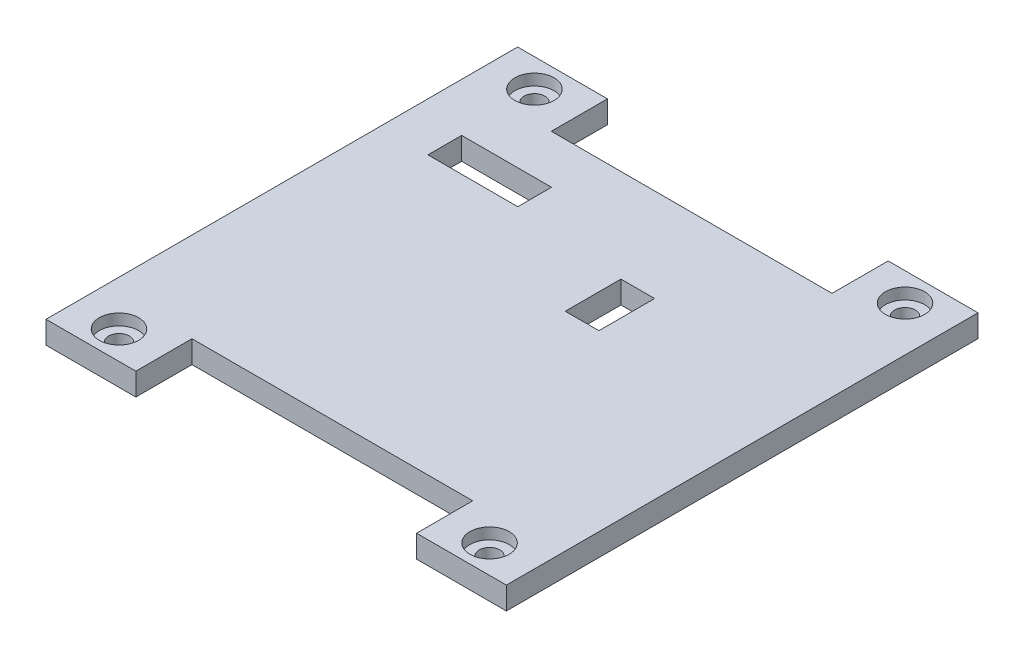
ISO-10303-21;
HEADER;
FILE_DESCRIPTION(('STEP AP214'),'2;1');
FILE_NAME('part.step','',(''),(''),'','','');
FILE_SCHEMA(('AUTOMOTIVE_DESIGN { 1 0 10303 214 1 1 1 1 }'));
ENDSEC;
DATA;
#1=APPLICATION_CONTEXT('core data for automotive mechanical design processes');
#2=APPLICATION_PROTOCOL_DEFINITION('international standard','automotive_design',2000,#1);
#3=PRODUCT_CONTEXT('',#1,'mechanical');
#4=PRODUCT('Part','Part','',(#3));
#5=PRODUCT_RELATED_PRODUCT_CATEGORY('part','',(#4));
#6=PRODUCT_DEFINITION_FORMATION('','',#4);
#7=PRODUCT_DEFINITION_CONTEXT('part definition',#1,'design');
#8=PRODUCT_DEFINITION('design','',#6,#7);
#9=PRODUCT_DEFINITION_SHAPE('','',#8);
#10=(LENGTH_UNIT() NAMED_UNIT(*) SI_UNIT(.MILLI.,.METRE.));
#11=(NAMED_UNIT(*) PLANE_ANGLE_UNIT() SI_UNIT($,.RADIAN.));
#12=(NAMED_UNIT(*) SI_UNIT($,.STERADIAN.) SOLID_ANGLE_UNIT());
#13=UNCERTAINTY_MEASURE_WITH_UNIT(LENGTH_MEASURE(1.E-05),#10,'distance_accuracy_value','');
#14=(GEOMETRIC_REPRESENTATION_CONTEXT(3) GLOBAL_UNCERTAINTY_ASSIGNED_CONTEXT((#13)) GLOBAL_UNIT_ASSIGNED_CONTEXT((#10,
#11,#12)) REPRESENTATION_CONTEXT('',''));
#15=CARTESIAN_POINT('',(0.,0.,0.));
#16=DIRECTION('',(0.,0.,1.));
#17=DIRECTION('',(1.,0.,0.));
#18=AXIS2_PLACEMENT_3D('',#15,#16,#17);
#19=CARTESIAN_POINT('',(0.,0.,0.));
#20=DIRECTION('',(0.,1.,0.));
#21=DIRECTION('',(0.,0.,1.));
#22=AXIS2_PLACEMENT_3D('',#19,#20,#21);
#23=PLANE('',#22);
#24=DIRECTION('',(1.,0.,0.));
#25=VECTOR('',#24,1.);
#26=CARTESIAN_POINT('',(-11.857851807008,0.,-11.019264119323));
#27=LINE('',#26,#25);
#28=CARTESIAN_POINT('',(-11.857851807008,0.,-11.019264119323));
#29=VERTEX_POINT('',#28);
#30=CARTESIAN_POINT('',(-3.85785180700805,0.,-11.019264119323));
#31=VERTEX_POINT('',#30);
#32=EDGE_CURVE('E248',#29,#31,#27,.T.);
#33=ORIENTED_EDGE('',*,*,#32,.F.);
#34=DIRECTION('',(0.,0.,-1.));
#35=VECTOR('',#34,1.);
#36=CARTESIAN_POINT('',(-11.857851807008,0.,-11.019264119323));
#37=LINE('',#36,#35);
#38=CARTESIAN_POINT('',(-11.857851807008,0.,-8.01926411932297));
#39=VERTEX_POINT('',#38);
#40=EDGE_CURVE('E51',#39,#29,#37,.T.);
#41=ORIENTED_EDGE('',*,*,#40,.F.);
#42=DIRECTION('',(-1.,0.,0.));
#43=VECTOR('',#42,1.);
#44=CARTESIAN_POINT('',(-11.857851807008,0.,-8.01926411932297));
#45=LINE('',#44,#43);
#46=CARTESIAN_POINT('',(-3.85785180700805,0.,-8.01926411932297));
#47=VERTEX_POINT('',#46);
#48=EDGE_CURVE('E237',#47,#39,#45,.T.);
#49=ORIENTED_EDGE('',*,*,#48,.F.);
#50=DIRECTION('',(0.,0.,1.));
#51=VECTOR('',#50,1.);
#52=CARTESIAN_POINT('',(-3.85785180700805,0.,-11.019264119323));
#53=LINE('',#52,#51);
#54=EDGE_CURVE('E251',#31,#47,#53,.T.);
#55=ORIENTED_EDGE('',*,*,#54,.F.);
#56=EDGE_LOOP('',(#33,#41,#49,#55));
#57=FACE_BOUND('',#56,.T.);
#58=DIRECTION('',(0.,0.,1.));
#59=VECTOR('',#58,1.);
#60=CARTESIAN_POINT('',(-16.1830985915493,0.,-15.3286384976526));
#61=LINE('',#60,#59);
#62=CARTESIAN_POINT('',(-16.1830985915493,0.,-20.3286384976526));
#63=VERTEX_POINT('',#62);
#64=CARTESIAN_POINT('',(-16.1830985915493,0.,21.6713615023474));
#65=VERTEX_POINT('',#64);
#66=EDGE_CURVE('E395',#63,#65,#61,.T.);
#67=ORIENTED_EDGE('',*,*,#66,.F.);
#68=DIRECTION('',(-1.,0.,0.));
#69=VECTOR('',#68,1.);
#70=CARTESIAN_POINT('',(-16.1830985915493,0.,-20.3286384976526));
#71=LINE('',#70,#69);
#72=CARTESIAN_POINT('',(-8.18309859154927,0.,-20.3286384976526));
#73=VERTEX_POINT('',#72);
#74=EDGE_CURVE('E383',#73,#63,#71,.T.);
#75=ORIENTED_EDGE('',*,*,#74,.F.);
#76=DIRECTION('',(0.,0.,1.));
#77=VECTOR('',#76,1.);
#78=CARTESIAN_POINT('',(-8.18309859154927,0.,-20.3286384976526));
#79=LINE('',#78,#77);
#80=CARTESIAN_POINT('',(-8.18309859154927,0.,-15.3286384976526));
#81=VERTEX_POINT('',#80);
#82=EDGE_CURVE('E386',#73,#81,#79,.T.);
#83=ORIENTED_EDGE('',*,*,#82,.T.);
#84=DIRECTION('',(-1.,0.,0.));
#85=VECTOR('',#84,1.);
#86=CARTESIAN_POINT('',(-16.1830985915493,0.,-15.3286384976526));
#87=LINE('',#86,#85);
#88=CARTESIAN_POINT('',(16.8169014084507,0.,-15.3286384976526));
#89=VERTEX_POINT('',#88);
#90=EDGE_CURVE('E11',#89,#81,#87,.T.);
#91=ORIENTED_EDGE('',*,*,#90,.F.);
#92=DIRECTION('',(0.,0.,1.));
#93=VECTOR('',#92,1.);
#94=CARTESIAN_POINT('',(16.8169014084507,0.,-20.3286384976526));
#95=LINE('',#94,#93);
#96=CARTESIAN_POINT('',(16.8169014084507,0.,-20.3286384976526));
#97=VERTEX_POINT('',#96);
#98=EDGE_CURVE('E372',#97,#89,#95,.T.);
#99=ORIENTED_EDGE('',*,*,#98,.F.);
#100=DIRECTION('',(-1.,0.,0.));
#101=VECTOR('',#100,1.);
#102=CARTESIAN_POINT('',(24.8169014084507,0.,-20.3286384976526));
#103=LINE('',#102,#101);
#104=CARTESIAN_POINT('',(24.8169014084507,0.,-20.3286384976526));
#105=VERTEX_POINT('',#104);
#106=EDGE_CURVE('E360',#105,#97,#103,.T.);
#107=ORIENTED_EDGE('',*,*,#106,.F.);
#108=DIRECTION('',(0.,0.,-1.));
#109=VECTOR('',#108,1.);
#110=CARTESIAN_POINT('',(24.8169014084507,0.,-15.3286384976526));
#111=LINE('',#110,#109);
#112=CARTESIAN_POINT('',(24.8169014084507,0.,21.6713615023474));
#113=VERTEX_POINT('',#112);
#114=EDGE_CURVE('E43',#113,#105,#111,.T.);
#115=ORIENTED_EDGE('',*,*,#114,.F.);
#116=DIRECTION('',(1.,0.,0.));
#117=VECTOR('',#116,1.);
#118=CARTESIAN_POINT('',(24.8169014084507,0.,21.6713615023474));
#119=LINE('',#118,#117);
#120=CARTESIAN_POINT('',(16.8169014084507,0.,21.6713615023474));
#121=VERTEX_POINT('',#120);
#122=EDGE_CURVE('E345',#121,#113,#119,.T.);
#123=ORIENTED_EDGE('',*,*,#122,.F.);
#124=DIRECTION('',(0.,0.,-1.));
#125=VECTOR('',#124,1.);
#126=CARTESIAN_POINT('',(16.8169014084507,0.,21.6713615023474));
#127=LINE('',#126,#125);
#128=CARTESIAN_POINT('',(16.8169014084507,0.,16.6713615023474));
#129=VERTEX_POINT('',#128);
#130=EDGE_CURVE('E348',#121,#129,#127,.T.);
#131=ORIENTED_EDGE('',*,*,#130,.T.);
#132=DIRECTION('',(1.,0.,0.));
#133=VECTOR('',#132,1.);
#134=CARTESIAN_POINT('',(-16.1830985915493,0.,16.6713615023474));
#135=LINE('',#134,#133);
#136=CARTESIAN_POINT('',(-8.18309859154927,0.,16.6713615023474));
#137=VERTEX_POINT('',#136);
#138=EDGE_CURVE('E397',#137,#129,#135,.T.);
#139=ORIENTED_EDGE('',*,*,#138,.F.);
#140=DIRECTION('',(0.,0.,-1.));
#141=VECTOR('',#140,1.);
#142=CARTESIAN_POINT('',(-8.18309859154927,0.,21.6713615023474));
#143=LINE('',#142,#141);
#144=CARTESIAN_POINT('',(-8.18309859154927,0.,21.6713615023474));
#145=VERTEX_POINT('',#144);
#146=EDGE_CURVE('E334',#145,#137,#143,.T.);
#147=ORIENTED_EDGE('',*,*,#146,.F.);
#148=DIRECTION('',(1.,0.,0.));
#149=VECTOR('',#148,1.);
#150=CARTESIAN_POINT('',(-16.1830985915493,0.,21.6713615023474));
#151=LINE('',#150,#149);
#152=EDGE_CURVE('E320',#65,#145,#151,.T.);
#153=ORIENTED_EDGE('',*,*,#152,.F.);
#154=EDGE_LOOP('',(#67,#75,#83,#91,#99,#107,#115,#123,#131,#139,#147,#153));
#155=FACE_BOUND('',#154,.T.);
#156=CARTESIAN_POINT('',(-12.1830985915493,0.,-17.8286384976526));
#157=DIRECTION('',(0.,1.,0.));
#158=DIRECTION('',(0.,0.,1.));
#159=AXIS2_PLACEMENT_3D('',#156,#157,#158);
#160=CIRCLE('',#159,0.925);
#161=CARTESIAN_POINT('',(-12.1830985915493,0.,-16.9036384976526));
#162=VERTEX_POINT('',#161);
#163=EDGE_CURVE('E407',#162,#162,#160,.T.);
#164=ORIENTED_EDGE('',*,*,#163,.T.);
#165=EDGE_LOOP('',(#164));
#166=FACE_BOUND('',#165,.T.);
#167=CARTESIAN_POINT('',(20.8169014084507,0.,-17.8286384976526));
#168=DIRECTION('',(0.,1.,0.));
#169=DIRECTION('',(0.,0.,1.));
#170=AXIS2_PLACEMENT_3D('',#167,#168,#169);
#171=CIRCLE('',#170,0.924999999999998);
#172=CARTESIAN_POINT('',(20.8169014084507,0.,-16.9036384976526));
#173=VERTEX_POINT('',#172);
#174=EDGE_CURVE('E410',#173,#173,#171,.T.);
#175=ORIENTED_EDGE('',*,*,#174,.T.);
#176=EDGE_LOOP('',(#175));
#177=FACE_BOUND('',#176,.T.);
#178=CARTESIAN_POINT('',(20.8169014084507,0.,19.1713615023474));
#179=DIRECTION('',(0.,1.,0.));
#180=DIRECTION('',(0.,0.,1.));
#181=AXIS2_PLACEMENT_3D('',#178,#179,#180);
#182=CIRCLE('',#181,0.924999999999998);
#183=CARTESIAN_POINT('',(20.8169014084507,0.,20.0963615023474));
#184=VERTEX_POINT('',#183);
#185=EDGE_CURVE('E413',#184,#184,#182,.T.);
#186=ORIENTED_EDGE('',*,*,#185,.T.);
#187=EDGE_LOOP('',(#186));
#188=FACE_BOUND('',#187,.T.);
#189=CARTESIAN_POINT('',(-12.1830985915493,0.,19.1713615023474));
#190=DIRECTION('',(0.,1.,0.));
#191=DIRECTION('',(0.,0.,1.));
#192=AXIS2_PLACEMENT_3D('',#189,#190,#191);
#193=CIRCLE('',#192,0.925);
#194=CARTESIAN_POINT('',(-12.1830985915493,0.,20.0963615023474));
#195=VERTEX_POINT('',#194);
#196=EDGE_CURVE('E331',#195,#195,#193,.T.);
#197=ORIENTED_EDGE('',*,*,#196,.T.);
#198=EDGE_LOOP('',(#197));
#199=FACE_BOUND('',#198,.T.);
#200=DIRECTION('',(1.,0.,0.));
#201=VECTOR('',#200,1.);
#202=CARTESIAN_POINT('',(9.31690140845073,0.,-7.02838257728644));
#203=LINE('',#202,#201);
#204=CARTESIAN_POINT('',(9.31690140845073,0.,-7.02838257728644));
#205=VERTEX_POINT('',#204);
#206=CARTESIAN_POINT('',(12.3169014084507,0.,-7.02838257728644));
#207=VERTEX_POINT('',#206);
#208=EDGE_CURVE('E274',#205,#207,#203,.T.);
#209=ORIENTED_EDGE('',*,*,#208,.F.);
#210=DIRECTION('',(1.,0.,0.));
#211=VECTOR('',#210,1.);
#212=CARTESIAN_POINT('',(9.31690140845073,0.,-7.02838257728644));
#213=LINE('',#212,#211);
#214=CARTESIAN_POINT('',(6.31690140845073,0.,-7.02838257728644));
#215=VERTEX_POINT('',#214);
#216=EDGE_CURVE('E216',#215,#205,#213,.T.);
#217=ORIENTED_EDGE('',*,*,#216,.F.);
#218=DIRECTION('',(0.,0.,-1.));
#219=VECTOR('',#218,1.);
#220=CARTESIAN_POINT('',(6.31690140845073,0.,-7.02838257728644));
#221=LINE('',#220,#219);
#222=CARTESIAN_POINT('',(6.31690140845073,0.,-2.06889220520878));
#223=VERTEX_POINT('',#222);
#224=EDGE_CURVE('E218',#223,#215,#221,.T.);
#225=ORIENTED_EDGE('',*,*,#224,.F.);
#226=DIRECTION('',(-1.,0.,0.));
#227=VECTOR('',#226,1.);
#228=CARTESIAN_POINT('',(9.31690140845073,0.,-2.06889220520878));
#229=LINE('',#228,#227);
#230=CARTESIAN_POINT('',(9.31690140845073,0.,-2.06889220520878));
#231=VERTEX_POINT('',#230);
#232=EDGE_CURVE('E223',#231,#223,#229,.T.);
#233=ORIENTED_EDGE('',*,*,#232,.F.);
#234=DIRECTION('',(0.,0.,-1.));
#235=VECTOR('',#234,1.);
#236=CARTESIAN_POINT('',(9.31690140845073,0.,-7.02838257728644));
#237=LINE('',#236,#235);
#238=CARTESIAN_POINT('',(9.31690140845073,0.,-2.02838257728644));
#239=VERTEX_POINT('',#238);
#240=EDGE_CURVE('E201',#239,#231,#237,.T.);
#241=ORIENTED_EDGE('',*,*,#240,.F.);
#242=DIRECTION('',(-1.,0.,0.));
#243=VECTOR('',#242,1.);
#244=CARTESIAN_POINT('',(9.31690140845073,0.,-2.02838257728644));
#245=LINE('',#244,#243);
#246=CARTESIAN_POINT('',(12.3169014084507,0.,-2.02838257728644));
#247=VERTEX_POINT('',#246);
#248=EDGE_CURVE('E266',#247,#239,#245,.T.);
#249=ORIENTED_EDGE('',*,*,#248,.F.);
#250=DIRECTION('',(0.,0.,1.));
#251=VECTOR('',#250,1.);
#252=CARTESIAN_POINT('',(12.3169014084507,0.,-7.02838257728644));
#253=LINE('',#252,#251);
#254=EDGE_CURVE('E277',#207,#247,#253,.T.);
#255=ORIENTED_EDGE('',*,*,#254,.F.);
#256=EDGE_LOOP('',(#209,#217,#225,#233,#241,#249,#255));
#257=FACE_BOUND('',#256,.T.);
#258=ADVANCED_FACE('F35',(#57,#155,#166,#177,#188,#199,#257),#23,.F.);
#259=CARTESIAN_POINT('',(-12.1830985915493,-3.,-17.8286384976526));
#260=DIRECTION('',(0.,1.,0.));
#261=DIRECTION('',(0.,0.,1.));
#262=AXIS2_PLACEMENT_3D('',#259,#260,#261);
#263=CYLINDRICAL_SURFACE('',#262,0.925);
#264=ORIENTED_EDGE('',*,*,#163,.F.);
#265=EDGE_LOOP('',(#264));
#266=FACE_BOUND('',#265,.T.);
#267=CARTESIAN_POINT('',(-12.1830985915493,1.,-17.8286384976526));
#268=DIRECTION('',(0.,1.,0.));
#269=DIRECTION('',(0.,0.,1.));
#270=AXIS2_PLACEMENT_3D('',#267,#268,#269);
#271=CIRCLE('',#270,0.925);
#272=CARTESIAN_POINT('',(-12.1830985915493,1.,-16.9036384976526));
#273=VERTEX_POINT('',#272);
#274=EDGE_CURVE('E38',#273,#273,#271,.F.);
#275=ORIENTED_EDGE('',*,*,#274,.F.);
#276=EDGE_LOOP('',(#275));
#277=FACE_BOUND('',#276,.T.);
#278=ADVANCED_FACE('F431',(#266,#277),#263,.F.);
#279=CARTESIAN_POINT('',(20.8169014084507,-3.,-17.8286384976526));
#280=DIRECTION('',(0.,1.,0.));
#281=DIRECTION('',(0.,0.,1.));
#282=AXIS2_PLACEMENT_3D('',#279,#280,#281);
#283=CYLINDRICAL_SURFACE('',#282,0.924999999999998);
#284=ORIENTED_EDGE('',*,*,#174,.F.);
#285=EDGE_LOOP('',(#284));
#286=FACE_BOUND('',#285,.T.);
#287=CARTESIAN_POINT('',(20.8169014084507,1.,-17.8286384976526));
#288=DIRECTION('',(0.,1.,0.));
#289=DIRECTION('',(0.,0.,1.));
#290=AXIS2_PLACEMENT_3D('',#287,#288,#289);
#291=CIRCLE('',#290,0.924999999999998);
#292=CARTESIAN_POINT('',(20.8169014084507,1.,-16.9036384976526));
#293=VERTEX_POINT('',#292);
#294=EDGE_CURVE('E422',#293,#293,#291,.F.);
#295=ORIENTED_EDGE('',*,*,#294,.F.);
#296=EDGE_LOOP('',(#295));
#297=FACE_BOUND('',#296,.T.);
#298=ADVANCED_FACE('F433',(#286,#297),#283,.F.);
#299=CARTESIAN_POINT('',(20.8169014084507,-3.,19.1713615023474));
#300=DIRECTION('',(0.,1.,0.));
#301=DIRECTION('',(0.,0.,1.));
#302=AXIS2_PLACEMENT_3D('',#299,#300,#301);
#303=CYLINDRICAL_SURFACE('',#302,0.924999999999998);
#304=ORIENTED_EDGE('',*,*,#185,.F.);
#305=EDGE_LOOP('',(#304));
#306=FACE_BOUND('',#305,.T.);
#307=CARTESIAN_POINT('',(20.8169014084507,1.,19.1713615023474));
#308=DIRECTION('',(0.,1.,0.));
#309=DIRECTION('',(0.,0.,1.));
#310=AXIS2_PLACEMENT_3D('',#307,#308,#309);
#311=CIRCLE('',#310,0.924999999999998);
#312=CARTESIAN_POINT('',(20.8169014084507,1.,20.0963615023474));
#313=VERTEX_POINT('',#312);
#314=EDGE_CURVE('E420',#313,#313,#311,.F.);
#315=ORIENTED_EDGE('',*,*,#314,.F.);
#316=EDGE_LOOP('',(#315));
#317=FACE_BOUND('',#316,.T.);
#318=ADVANCED_FACE('F440',(#306,#317),#303,.F.);
#319=CARTESIAN_POINT('',(-12.1830985915493,-3.,19.1713615023474));
#320=DIRECTION('',(0.,1.,0.));
#321=DIRECTION('',(0.,0.,1.));
#322=AXIS2_PLACEMENT_3D('',#319,#320,#321);
#323=CYLINDRICAL_SURFACE('',#322,0.925);
#324=ORIENTED_EDGE('',*,*,#196,.F.);
#325=EDGE_LOOP('',(#324));
#326=FACE_BOUND('',#325,.T.);
#327=CARTESIAN_POINT('',(-12.1830985915493,1.,19.1713615023474));
#328=DIRECTION('',(0.,1.,0.));
#329=DIRECTION('',(0.,0.,1.));
#330=AXIS2_PLACEMENT_3D('',#327,#328,#329);
#331=CIRCLE('',#330,0.925);
#332=CARTESIAN_POINT('',(-12.1830985915493,1.,20.0963615023474));
#333=VERTEX_POINT('',#332);
#334=EDGE_CURVE('E314',#333,#333,#331,.F.);
#335=ORIENTED_EDGE('',*,*,#334,.F.);
#336=EDGE_LOOP('',(#335));
#337=FACE_BOUND('',#336,.T.);
#338=ADVANCED_FACE('F447',(#326,#337),#323,.F.);
#339=CARTESIAN_POINT('',(-16.1830985915493,0.,16.6713615023474));
#340=DIRECTION('',(0.,0.,1.));
#341=DIRECTION('',(1.,0.,0.));
#342=AXIS2_PLACEMENT_3D('',#339,#340,#341);
#343=PLANE('',#342);
#344=DIRECTION('',(1.,0.,0.));
#345=VECTOR('',#344,1.);
#346=CARTESIAN_POINT('',(-16.1830985915493,2.,16.6713615023474));
#347=LINE('',#346,#345);
#348=CARTESIAN_POINT('',(-8.18309859154927,2.,16.6713615023474));
#349=VERTEX_POINT('',#348);
#350=CARTESIAN_POINT('',(16.8169014084507,2.,16.6713615023474));
#351=VERTEX_POINT('',#350);
#352=EDGE_CURVE('E402',#349,#351,#347,.T.);
#353=ORIENTED_EDGE('',*,*,#352,.F.);
#354=DIRECTION('',(0.,1.,0.));
#355=VECTOR('',#354,1.);
#356=CARTESIAN_POINT('',(-8.18309859154927,0.,16.6713615023474));
#357=LINE('',#356,#355);
#358=EDGE_CURVE('E321',#137,#349,#357,.T.);
#359=ORIENTED_EDGE('',*,*,#358,.F.);
#360=ORIENTED_EDGE('',*,*,#138,.T.);
#361=DIRECTION('',(0.,-1.,0.));
#362=VECTOR('',#361,1.);
#363=CARTESIAN_POINT('',(16.8169014084507,0.,16.6713615023474));
#364=LINE('',#363,#362);
#365=EDGE_CURVE('E337',#351,#129,#364,.T.);
#366=ORIENTED_EDGE('',*,*,#365,.F.);
#367=EDGE_LOOP('',(#353,#359,#360,#366));
#368=FACE_BOUND('',#367,.T.);
#369=ADVANCED_FACE('F486',(#368),#343,.T.);
#370=CARTESIAN_POINT('',(-16.1830985915493,0.,-15.3286384976526));
#371=DIRECTION('',(0.,0.,-1.));
#372=DIRECTION('',(-1.,0.,0.));
#373=AXIS2_PLACEMENT_3D('',#370,#371,#372);
#374=PLANE('',#373);
#375=DIRECTION('',(-1.,0.,0.));
#376=VECTOR('',#375,1.);
#377=CARTESIAN_POINT('',(-16.1830985915493,2.,-15.3286384976526));
#378=LINE('',#377,#376);
#379=CARTESIAN_POINT('',(16.8169014084507,2.,-15.3286384976526));
#380=VERTEX_POINT('',#379);
#381=CARTESIAN_POINT('',(-8.18309859154927,2.,-15.3286384976526));
#382=VERTEX_POINT('',#381);
#383=EDGE_CURVE('E398',#380,#382,#378,.T.);
#384=ORIENTED_EDGE('',*,*,#383,.F.);
#385=DIRECTION('',(0.,1.,0.));
#386=VECTOR('',#385,1.);
#387=CARTESIAN_POINT('',(16.8169014084507,2.,-15.3286384976526));
#388=LINE('',#387,#386);
#389=EDGE_CURVE('E356',#89,#380,#388,.T.);
#390=ORIENTED_EDGE('',*,*,#389,.F.);
#391=ORIENTED_EDGE('',*,*,#90,.T.);
#392=DIRECTION('',(0.,-1.,0.));
#393=VECTOR('',#392,1.);
#394=CARTESIAN_POINT('',(-8.18309859154927,2.,-15.3286384976526));
#395=LINE('',#394,#393);
#396=EDGE_CURVE('E375',#382,#81,#395,.T.);
#397=ORIENTED_EDGE('',*,*,#396,.F.);
#398=EDGE_LOOP('',(#384,#390,#391,#397));
#399=FACE_BOUND('',#398,.T.);
#400=ADVANCED_FACE('F482',(#399),#374,.T.);
#401=CARTESIAN_POINT('',(-16.1830985915493,0.,-15.3286384976526));
#402=DIRECTION('',(-1.,0.,0.));
#403=DIRECTION('',(0.,0.,1.));
#404=AXIS2_PLACEMENT_3D('',#401,#402,#403);
#405=PLANE('',#404);
#406=DIRECTION('',(0.,0.,1.));
#407=VECTOR('',#406,1.);
#408=CARTESIAN_POINT('',(-16.1830985915493,2.,-15.3286384976526));
#409=LINE('',#408,#407);
#410=CARTESIAN_POINT('',(-16.1830985915493,2.,-20.3286384976526));
#411=VERTEX_POINT('',#410);
#412=CARTESIAN_POINT('',(-16.1830985915493,2.,21.6713615023474));
#413=VERTEX_POINT('',#412);
#414=EDGE_CURVE('E394',#411,#413,#409,.T.);
#415=ORIENTED_EDGE('',*,*,#414,.F.);
#416=DIRECTION('',(0.,1.,0.));
#417=VECTOR('',#416,1.);
#418=CARTESIAN_POINT('',(-16.1830985915493,2.,-20.3286384976526));
#419=LINE('',#418,#417);
#420=EDGE_CURVE('E376',#63,#411,#419,.T.);
#421=ORIENTED_EDGE('',*,*,#420,.F.);
#422=ORIENTED_EDGE('',*,*,#66,.T.);
#423=DIRECTION('',(0.,-1.,0.));
#424=VECTOR('',#423,1.);
#425=CARTESIAN_POINT('',(-16.1830985915493,0.,21.6713615023474));
#426=LINE('',#425,#424);
#427=EDGE_CURVE('E317',#413,#65,#426,.T.);
#428=ORIENTED_EDGE('',*,*,#427,.F.);
#429=EDGE_LOOP('',(#415,#421,#422,#428));
#430=FACE_BOUND('',#429,.T.);
#431=ADVANCED_FACE('F485',(#430),#405,.T.);
#432=CARTESIAN_POINT('',(24.8169014084507,0.,-15.3286384976526));
#433=DIRECTION('',(1.,0.,0.));
#434=DIRECTION('',(0.,0.,-1.));
#435=AXIS2_PLACEMENT_3D('',#432,#433,#434);
#436=PLANE('',#435);
#437=DIRECTION('',(0.,0.,-1.));
#438=VECTOR('',#437,1.);
#439=CARTESIAN_POINT('',(24.8169014084507,2.,-15.3286384976526));
#440=LINE('',#439,#438);
#441=CARTESIAN_POINT('',(24.8169014084507,2.,21.6713615023474));
#442=VERTEX_POINT('',#441);
#443=CARTESIAN_POINT('',(24.8169014084507,2.,-20.3286384976526));
#444=VERTEX_POINT('',#443);
#445=EDGE_CURVE('E404',#442,#444,#440,.T.);
#446=ORIENTED_EDGE('',*,*,#445,.F.);
#447=DIRECTION('',(0.,1.,0.));
#448=VECTOR('',#447,1.);
#449=CARTESIAN_POINT('',(24.8169014084507,0.,21.6713615023474));
#450=LINE('',#449,#448);
#451=EDGE_CURVE('E338',#113,#442,#450,.T.);
#452=ORIENTED_EDGE('',*,*,#451,.F.);
#453=ORIENTED_EDGE('',*,*,#114,.T.);
#454=DIRECTION('',(0.,-1.,0.));
#455=VECTOR('',#454,1.);
#456=CARTESIAN_POINT('',(24.8169014084507,2.,-20.3286384976526));
#457=LINE('',#456,#455);
#458=EDGE_CURVE('E357',#444,#105,#457,.T.);
#459=ORIENTED_EDGE('',*,*,#458,.F.);
#460=EDGE_LOOP('',(#446,#452,#453,#459));
#461=FACE_BOUND('',#460,.T.);
#462=ADVANCED_FACE('F488',(#461),#436,.T.);
#463=CARTESIAN_POINT('',(0.,2.,0.));
#464=DIRECTION('',(0.,1.,0.));
#465=DIRECTION('',(0.,0.,1.));
#466=AXIS2_PLACEMENT_3D('',#463,#464,#465);
#467=PLANE('',#466);
#468=DIRECTION('',(0.,0.,1.));
#469=VECTOR('',#468,1.);
#470=CARTESIAN_POINT('',(9.31690140845073,2.,-7.02838257728644));
#471=LINE('',#470,#469);
#472=CARTESIAN_POINT('',(9.31690140845073,2.,-7.02838257728644));
#473=VERTEX_POINT('',#472);
#474=CARTESIAN_POINT('',(9.31690140845073,2.,-2.06889220520878));
#475=VERTEX_POINT('',#474);
#476=EDGE_CURVE('E198',#473,#475,#471,.T.);
#477=ORIENTED_EDGE('',*,*,#476,.T.);
#478=DIRECTION('',(-1.,0.,0.));
#479=VECTOR('',#478,1.);
#480=CARTESIAN_POINT('',(9.31690140845073,2.,-2.06889220520878));
#481=LINE('',#480,#479);
#482=CARTESIAN_POINT('',(6.31690140845073,2.,-2.06889220520878));
#483=VERTEX_POINT('',#482);
#484=EDGE_CURVE('E209',#475,#483,#481,.T.);
#485=ORIENTED_EDGE('',*,*,#484,.T.);
#486=DIRECTION('',(0.,0.,-1.));
#487=VECTOR('',#486,1.);
#488=CARTESIAN_POINT('',(6.31690140845073,2.,-7.02838257728644));
#489=LINE('',#488,#487);
#490=CARTESIAN_POINT('',(6.31690140845073,2.,-7.02838257728644));
#491=VERTEX_POINT('',#490);
#492=EDGE_CURVE('E59',#483,#491,#489,.T.);
#493=ORIENTED_EDGE('',*,*,#492,.T.);
#494=DIRECTION('',(1.,0.,0.));
#495=VECTOR('',#494,1.);
#496=CARTESIAN_POINT('',(9.31690140845073,2.,-7.02838257728644));
#497=LINE('',#496,#495);
#498=EDGE_CURVE('E206',#491,#473,#497,.T.);
#499=ORIENTED_EDGE('',*,*,#498,.T.);
#500=EDGE_LOOP('',(#477,#485,#493,#499));
#501=FACE_BOUND('',#500,.T.);
#502=DIRECTION('',(0.,0.,-1.));
#503=VECTOR('',#502,1.);
#504=CARTESIAN_POINT('',(-11.857851807008,2.,-11.019264119323));
#505=LINE('',#504,#503);
#506=CARTESIAN_POINT('',(-11.857851807008,2.,-8.01926411932297));
#507=VERTEX_POINT('',#506);
#508=CARTESIAN_POINT('',(-11.857851807008,2.,-11.019264119323));
#509=VERTEX_POINT('',#508);
#510=EDGE_CURVE('E233',#507,#509,#505,.T.);
#511=ORIENTED_EDGE('',*,*,#510,.T.);
#512=DIRECTION('',(1.,0.,0.));
#513=VECTOR('',#512,1.);
#514=CARTESIAN_POINT('',(-11.857851807008,2.,-11.019264119323));
#515=LINE('',#514,#513);
#516=CARTESIAN_POINT('',(-3.85785180700805,2.,-11.019264119323));
#517=VERTEX_POINT('',#516);
#518=EDGE_CURVE('E236',#509,#517,#515,.T.);
#519=ORIENTED_EDGE('',*,*,#518,.T.);
#520=DIRECTION('',(0.,0.,1.));
#521=VECTOR('',#520,1.);
#522=CARTESIAN_POINT('',(-3.85785180700805,2.,-11.019264119323));
#523=LINE('',#522,#521);
#524=CARTESIAN_POINT('',(-3.85785180700805,2.,-8.01926411932297));
#525=VERTEX_POINT('',#524);
#526=EDGE_CURVE('E240',#517,#525,#523,.T.);
#527=ORIENTED_EDGE('',*,*,#526,.T.);
#528=DIRECTION('',(-1.,0.,0.));
#529=VECTOR('',#528,1.);
#530=CARTESIAN_POINT('',(-11.857851807008,2.,-8.01926411932297));
#531=LINE('',#530,#529);
#532=EDGE_CURVE('E243',#525,#507,#531,.T.);
#533=ORIENTED_EDGE('',*,*,#532,.T.);
#534=EDGE_LOOP('',(#511,#519,#527,#533));
#535=FACE_BOUND('',#534,.T.);
#536=CARTESIAN_POINT('',(-12.1830985915493,2.,19.1713615023474));
#537=DIRECTION('',(0.,1.,0.));
#538=DIRECTION('',(0.,0.,1.));
#539=AXIS2_PLACEMENT_3D('',#536,#537,#538);
#540=CIRCLE('',#539,1.75);
#541=CARTESIAN_POINT('',(-12.1830985915493,2.,20.9213615023474));
#542=VERTEX_POINT('',#541);
#543=EDGE_CURVE('E292',#542,#542,#540,.T.);
#544=ORIENTED_EDGE('',*,*,#543,.F.);
#545=EDGE_LOOP('',(#544));
#546=FACE_BOUND('',#545,.T.);
#547=CARTESIAN_POINT('',(20.8169014084507,2.,19.1713615023474));
#548=DIRECTION('',(0.,1.,0.));
#549=DIRECTION('',(0.,0.,1.));
#550=AXIS2_PLACEMENT_3D('',#547,#548,#549);
#551=CIRCLE('',#550,1.75);
#552=CARTESIAN_POINT('',(20.8169014084507,2.,20.9213615023474));
#553=VERTEX_POINT('',#552);
#554=EDGE_CURVE('E303',#553,#553,#551,.T.);
#555=ORIENTED_EDGE('',*,*,#554,.F.);
#556=EDGE_LOOP('',(#555));
#557=FACE_BOUND('',#556,.T.);
#558=CARTESIAN_POINT('',(20.8169014084507,2.,-17.8286384976526));
#559=DIRECTION('',(0.,1.,0.));
#560=DIRECTION('',(0.,0.,1.));
#561=AXIS2_PLACEMENT_3D('',#558,#559,#560);
#562=CIRCLE('',#561,1.75);
#563=CARTESIAN_POINT('',(20.8169014084507,2.,-16.0786384976526));
#564=VERTEX_POINT('',#563);
#565=EDGE_CURVE('E297',#564,#564,#562,.T.);
#566=ORIENTED_EDGE('',*,*,#565,.F.);
#567=EDGE_LOOP('',(#566));
#568=FACE_BOUND('',#567,.T.);
#569=CARTESIAN_POINT('',(-12.1830985915493,2.,-17.8286384976526));
#570=DIRECTION('',(0.,1.,0.));
#571=DIRECTION('',(0.,0.,1.));
#572=AXIS2_PLACEMENT_3D('',#569,#570,#571);
#573=CIRCLE('',#572,1.75);
#574=CARTESIAN_POINT('',(-12.1830985915493,2.,-16.0786384976526));
#575=VERTEX_POINT('',#574);
#576=EDGE_CURVE('E296',#575,#575,#573,.T.);
#577=ORIENTED_EDGE('',*,*,#576,.F.);
#578=EDGE_LOOP('',(#577));
#579=FACE_BOUND('',#578,.T.);
#580=ORIENTED_EDGE('',*,*,#414,.T.);
#581=DIRECTION('',(-1.,0.,0.));
#582=VECTOR('',#581,1.);
#583=CARTESIAN_POINT('',(-16.1830985915493,2.,21.6713615023474));
#584=LINE('',#583,#582);
#585=CARTESIAN_POINT('',(-8.18309859154927,2.,21.6713615023474));
#586=VERTEX_POINT('',#585);
#587=EDGE_CURVE('E325',#586,#413,#584,.T.);
#588=ORIENTED_EDGE('',*,*,#587,.F.);
#589=DIRECTION('',(0.,0.,-1.));
#590=VECTOR('',#589,1.);
#591=CARTESIAN_POINT('',(-8.18309859154927,2.,21.6713615023474));
#592=LINE('',#591,#590);
#593=EDGE_CURVE('E328',#586,#349,#592,.T.);
#594=ORIENTED_EDGE('',*,*,#593,.T.);
#595=ORIENTED_EDGE('',*,*,#352,.T.);
#596=DIRECTION('',(0.,0.,-1.));
#597=VECTOR('',#596,1.);
#598=CARTESIAN_POINT('',(16.8169014084507,2.,21.6713615023474));
#599=LINE('',#598,#597);
#600=CARTESIAN_POINT('',(16.8169014084507,2.,21.6713615023474));
#601=VERTEX_POINT('',#600);
#602=EDGE_CURVE('E353',#601,#351,#599,.T.);
#603=ORIENTED_EDGE('',*,*,#602,.F.);
#604=DIRECTION('',(-1.,0.,0.));
#605=VECTOR('',#604,1.);
#606=CARTESIAN_POINT('',(24.8169014084507,2.,21.6713615023474));
#607=LINE('',#606,#605);
#608=EDGE_CURVE('E341',#442,#601,#607,.T.);
#609=ORIENTED_EDGE('',*,*,#608,.F.);
#610=ORIENTED_EDGE('',*,*,#445,.T.);
#611=DIRECTION('',(1.,0.,0.));
#612=VECTOR('',#611,1.);
#613=CARTESIAN_POINT('',(24.8169014084507,2.,-20.3286384976526));
#614=LINE('',#613,#612);
#615=CARTESIAN_POINT('',(16.8169014084507,2.,-20.3286384976526));
#616=VERTEX_POINT('',#615);
#617=EDGE_CURVE('E364',#616,#444,#614,.T.);
#618=ORIENTED_EDGE('',*,*,#617,.F.);
#619=DIRECTION('',(0.,0.,1.));
#620=VECTOR('',#619,1.);
#621=CARTESIAN_POINT('',(16.8169014084507,2.,-20.3286384976526));
#622=LINE('',#621,#620);
#623=EDGE_CURVE('E367',#616,#380,#622,.T.);
#624=ORIENTED_EDGE('',*,*,#623,.T.);
#625=ORIENTED_EDGE('',*,*,#383,.T.);
#626=DIRECTION('',(0.,0.,1.));
#627=VECTOR('',#626,1.);
#628=CARTESIAN_POINT('',(-8.18309859154927,2.,-20.3286384976526));
#629=LINE('',#628,#627);
#630=CARTESIAN_POINT('',(-8.18309859154927,2.,-20.3286384976526));
#631=VERTEX_POINT('',#630);
#632=EDGE_CURVE('E391',#631,#382,#629,.T.);
#633=ORIENTED_EDGE('',*,*,#632,.F.);
#634=DIRECTION('',(1.,0.,0.));
#635=VECTOR('',#634,1.);
#636=CARTESIAN_POINT('',(-16.1830985915493,2.,-20.3286384976526));
#637=LINE('',#636,#635);
#638=EDGE_CURVE('E379',#411,#631,#637,.T.);
#639=ORIENTED_EDGE('',*,*,#638,.F.);
#640=EDGE_LOOP('',(#580,#588,#594,#595,#603,#609,#610,#618,#624,#625,#633,#639));
#641=FACE_BOUND('',#640,.T.);
#642=ADVANCED_FACE('F213',(#501,#535,#546,#557,#568,#579,#641),#467,.T.);
#643=CARTESIAN_POINT('',(-8.18309859154927,2.,-20.3286384976526));
#644=DIRECTION('',(-1.,0.,0.));
#645=DIRECTION('',(0.,0.,1.));
#646=AXIS2_PLACEMENT_3D('',#643,#644,#645);
#647=PLANE('',#646);
#648=ORIENTED_EDGE('',*,*,#396,.T.);
#649=ORIENTED_EDGE('',*,*,#82,.F.);
#650=DIRECTION('',(0.,-1.,0.));
#651=VECTOR('',#650,1.);
#652=CARTESIAN_POINT('',(-8.18309859154927,2.,-20.3286384976526));
#653=LINE('',#652,#651);
#654=EDGE_CURVE('E381',#631,#73,#653,.T.);
#655=ORIENTED_EDGE('',*,*,#654,.F.);
#656=ORIENTED_EDGE('',*,*,#632,.T.);
#657=EDGE_LOOP('',(#648,#649,#655,#656));
#658=FACE_BOUND('',#657,.T.);
#659=ADVANCED_FACE('F477',(#658),#647,.F.);
#660=CARTESIAN_POINT('',(0.,0.,-20.3286384976526));
#661=DIRECTION('',(0.,0.,1.));
#662=DIRECTION('',(1.,0.,0.));
#663=AXIS2_PLACEMENT_3D('',#660,#661,#662);
#664=PLANE('',#663);
#665=ORIENTED_EDGE('',*,*,#420,.T.);
#666=ORIENTED_EDGE('',*,*,#638,.T.);
#667=ORIENTED_EDGE('',*,*,#654,.T.);
#668=ORIENTED_EDGE('',*,*,#74,.T.);
#669=EDGE_LOOP('',(#665,#666,#667,#668));
#670=FACE_BOUND('',#669,.T.);
#671=ADVANCED_FACE('F473',(#670),#664,.F.);
#672=CARTESIAN_POINT('',(16.8169014084507,2.,-20.3286384976526));
#673=DIRECTION('',(1.,0.,0.));
#674=DIRECTION('',(0.,0.,-1.));
#675=AXIS2_PLACEMENT_3D('',#672,#673,#674);
#676=PLANE('',#675);
#677=ORIENTED_EDGE('',*,*,#389,.T.);
#678=ORIENTED_EDGE('',*,*,#623,.F.);
#679=DIRECTION('',(0.,1.,0.));
#680=VECTOR('',#679,1.);
#681=CARTESIAN_POINT('',(16.8169014084507,2.,-20.3286384976526));
#682=LINE('',#681,#680);
#683=EDGE_CURVE('E362',#97,#616,#682,.T.);
#684=ORIENTED_EDGE('',*,*,#683,.F.);
#685=ORIENTED_EDGE('',*,*,#98,.T.);
#686=EDGE_LOOP('',(#677,#678,#684,#685));
#687=FACE_BOUND('',#686,.T.);
#688=ADVANCED_FACE('F469',(#687),#676,.F.);
#689=CARTESIAN_POINT('',(0.,0.,-20.3286384976526));
#690=DIRECTION('',(0.,0.,-1.));
#691=DIRECTION('',(-1.,0.,0.));
#692=AXIS2_PLACEMENT_3D('',#689,#690,#691);
#693=PLANE('',#692);
#694=ORIENTED_EDGE('',*,*,#458,.T.);
#695=ORIENTED_EDGE('',*,*,#106,.T.);
#696=ORIENTED_EDGE('',*,*,#683,.T.);
#697=ORIENTED_EDGE('',*,*,#617,.T.);
#698=EDGE_LOOP('',(#694,#695,#696,#697));
#699=FACE_BOUND('',#698,.T.);
#700=ADVANCED_FACE('F465',(#699),#693,.T.);
#701=CARTESIAN_POINT('',(16.8169014084507,0.,21.6713615023474));
#702=DIRECTION('',(1.,0.,0.));
#703=DIRECTION('',(0.,0.,-1.));
#704=AXIS2_PLACEMENT_3D('',#701,#702,#703);
#705=PLANE('',#704);
#706=ORIENTED_EDGE('',*,*,#365,.T.);
#707=ORIENTED_EDGE('',*,*,#130,.F.);
#708=DIRECTION('',(0.,-1.,0.));
#709=VECTOR('',#708,1.);
#710=CARTESIAN_POINT('',(16.8169014084507,0.,21.6713615023474));
#711=LINE('',#710,#709);
#712=EDGE_CURVE('E343',#601,#121,#711,.T.);
#713=ORIENTED_EDGE('',*,*,#712,.F.);
#714=ORIENTED_EDGE('',*,*,#602,.T.);
#715=EDGE_LOOP('',(#706,#707,#713,#714));
#716=FACE_BOUND('',#715,.T.);
#717=ADVANCED_FACE('F461',(#716),#705,.F.);
#718=CARTESIAN_POINT('',(0.,0.,21.6713615023474));
#719=DIRECTION('',(0.,0.,1.));
#720=DIRECTION('',(1.,0.,0.));
#721=AXIS2_PLACEMENT_3D('',#718,#719,#720);
#722=PLANE('',#721);
#723=ORIENTED_EDGE('',*,*,#451,.T.);
#724=ORIENTED_EDGE('',*,*,#608,.T.);
#725=ORIENTED_EDGE('',*,*,#712,.T.);
#726=ORIENTED_EDGE('',*,*,#122,.T.);
#727=EDGE_LOOP('',(#723,#724,#725,#726));
#728=FACE_BOUND('',#727,.T.);
#729=ADVANCED_FACE('F457',(#728),#722,.T.);
#730=CARTESIAN_POINT('',(-8.18309859154927,0.,21.6713615023474));
#731=DIRECTION('',(-1.,0.,0.));
#732=DIRECTION('',(0.,0.,1.));
#733=AXIS2_PLACEMENT_3D('',#730,#731,#732);
#734=PLANE('',#733);
#735=ORIENTED_EDGE('',*,*,#358,.T.);
#736=ORIENTED_EDGE('',*,*,#593,.F.);
#737=DIRECTION('',(0.,1.,0.));
#738=VECTOR('',#737,1.);
#739=CARTESIAN_POINT('',(-8.18309859154927,0.,21.6713615023474));
#740=LINE('',#739,#738);
#741=EDGE_CURVE('E323',#145,#586,#740,.T.);
#742=ORIENTED_EDGE('',*,*,#741,.F.);
#743=ORIENTED_EDGE('',*,*,#146,.T.);
#744=EDGE_LOOP('',(#735,#736,#742,#743));
#745=FACE_BOUND('',#744,.T.);
#746=ADVANCED_FACE('F453',(#745),#734,.F.);
#747=CARTESIAN_POINT('',(0.,0.,21.6713615023474));
#748=DIRECTION('',(0.,0.,-1.));
#749=DIRECTION('',(-1.,0.,0.));
#750=AXIS2_PLACEMENT_3D('',#747,#748,#749);
#751=PLANE('',#750);
#752=ORIENTED_EDGE('',*,*,#427,.T.);
#753=ORIENTED_EDGE('',*,*,#152,.T.);
#754=ORIENTED_EDGE('',*,*,#741,.T.);
#755=ORIENTED_EDGE('',*,*,#587,.T.);
#756=EDGE_LOOP('',(#752,#753,#754,#755));
#757=FACE_BOUND('',#756,.T.);
#758=ADVANCED_FACE('F449',(#757),#751,.F.);
#759=CARTESIAN_POINT('',(-12.1830985915493,1.,19.1713615023474));
#760=DIRECTION('',(0.,1.,0.));
#761=DIRECTION('',(0.,0.,1.));
#762=AXIS2_PLACEMENT_3D('',#759,#760,#761);
#763=PLANE('',#762);
#764=CARTESIAN_POINT('',(-12.1830985915493,1.,19.1713615023474));
#765=DIRECTION('',(0.,1.,0.));
#766=DIRECTION('',(0.,0.,1.));
#767=AXIS2_PLACEMENT_3D('',#764,#765,#766);
#768=CIRCLE('',#767,1.75);
#769=CARTESIAN_POINT('',(-12.1830985915493,1.,20.9213615023474));
#770=VERTEX_POINT('',#769);
#771=EDGE_CURVE('E306',#770,#770,#768,.T.);
#772=ORIENTED_EDGE('',*,*,#771,.T.);
#773=EDGE_LOOP('',(#772));
#774=FACE_BOUND('',#773,.T.);
#775=ORIENTED_EDGE('',*,*,#334,.T.);
#776=EDGE_LOOP('',(#775));
#777=FACE_BOUND('',#776,.T.);
#778=ADVANCED_FACE('F452',(#774,#777),#763,.T.);
#779=CARTESIAN_POINT('',(-12.1830985915493,1.,19.1713615023474));
#780=DIRECTION('',(0.,1.,0.));
#781=DIRECTION('',(0.,0.,1.));
#782=AXIS2_PLACEMENT_3D('',#779,#780,#781);
#783=CYLINDRICAL_SURFACE('',#782,1.75);
#784=ORIENTED_EDGE('',*,*,#771,.F.);
#785=EDGE_LOOP('',(#784));
#786=FACE_BOUND('',#785,.T.);
#787=ORIENTED_EDGE('',*,*,#543,.T.);
#788=EDGE_LOOP('',(#787));
#789=FACE_BOUND('',#788,.T.);
#790=ADVANCED_FACE('F544',(#786,#789),#783,.F.);
#791=CARTESIAN_POINT('',(20.8169014084507,1.,19.1713615023474));
#792=DIRECTION('',(0.,1.,0.));
#793=DIRECTION('',(0.,0.,1.));
#794=AXIS2_PLACEMENT_3D('',#791,#792,#793);
#795=PLANE('',#794);
#796=CARTESIAN_POINT('',(20.8169014084507,1.,19.1713615023474));
#797=DIRECTION('',(0.,1.,0.));
#798=DIRECTION('',(0.,0.,1.));
#799=AXIS2_PLACEMENT_3D('',#796,#797,#798);
#800=CIRCLE('',#799,1.75);
#801=CARTESIAN_POINT('',(20.8169014084507,1.,20.9213615023474));
#802=VERTEX_POINT('',#801);
#803=EDGE_CURVE('E300',#802,#802,#800,.T.);
#804=ORIENTED_EDGE('',*,*,#803,.T.);
#805=EDGE_LOOP('',(#804));
#806=FACE_BOUND('',#805,.T.);
#807=ORIENTED_EDGE('',*,*,#314,.T.);
#808=EDGE_LOOP('',(#807));
#809=FACE_BOUND('',#808,.T.);
#810=ADVANCED_FACE('F553',(#806,#809),#795,.T.);
#811=CARTESIAN_POINT('',(20.8169014084507,1.,19.1713615023474));
#812=DIRECTION('',(0.,1.,0.));
#813=DIRECTION('',(0.,0.,1.));
#814=AXIS2_PLACEMENT_3D('',#811,#812,#813);
#815=CYLINDRICAL_SURFACE('',#814,1.75);
#816=ORIENTED_EDGE('',*,*,#803,.F.);
#817=EDGE_LOOP('',(#816));
#818=FACE_BOUND('',#817,.T.);
#819=ORIENTED_EDGE('',*,*,#554,.T.);
#820=EDGE_LOOP('',(#819));
#821=FACE_BOUND('',#820,.T.);
#822=ADVANCED_FACE('F561',(#818,#821),#815,.F.);
#823=CARTESIAN_POINT('',(20.8169014084507,1.,-17.8286384976526));
#824=DIRECTION('',(0.,1.,0.));
#825=DIRECTION('',(0.,0.,1.));
#826=AXIS2_PLACEMENT_3D('',#823,#824,#825);
#827=PLANE('',#826);
#828=CARTESIAN_POINT('',(20.8169014084507,1.,-17.8286384976526));
#829=DIRECTION('',(0.,1.,0.));
#830=DIRECTION('',(0.,0.,1.));
#831=AXIS2_PLACEMENT_3D('',#828,#829,#830);
#832=CIRCLE('',#831,1.75);
#833=CARTESIAN_POINT('',(20.8169014084507,1.,-16.0786384976526));
#834=VERTEX_POINT('',#833);
#835=EDGE_CURVE('E293',#834,#834,#832,.T.);
#836=ORIENTED_EDGE('',*,*,#835,.T.);
#837=EDGE_LOOP('',(#836));
#838=FACE_BOUND('',#837,.T.);
#839=ORIENTED_EDGE('',*,*,#294,.T.);
#840=EDGE_LOOP('',(#839));
#841=FACE_BOUND('',#840,.T.);
#842=ADVANCED_FACE('F569',(#838,#841),#827,.T.);
#843=CARTESIAN_POINT('',(20.8169014084507,1.,-17.8286384976526));
#844=DIRECTION('',(0.,1.,0.));
#845=DIRECTION('',(0.,0.,1.));
#846=AXIS2_PLACEMENT_3D('',#843,#844,#845);
#847=CYLINDRICAL_SURFACE('',#846,1.75);
#848=ORIENTED_EDGE('',*,*,#835,.F.);
#849=EDGE_LOOP('',(#848));
#850=FACE_BOUND('',#849,.T.);
#851=ORIENTED_EDGE('',*,*,#565,.T.);
#852=EDGE_LOOP('',(#851));
#853=FACE_BOUND('',#852,.T.);
#854=ADVANCED_FACE('F577',(#850,#853),#847,.F.);
#855=CARTESIAN_POINT('',(-12.1830985915493,1.,-17.8286384976526));
#856=DIRECTION('',(0.,1.,0.));
#857=DIRECTION('',(0.,0.,1.));
#858=AXIS2_PLACEMENT_3D('',#855,#856,#857);
#859=PLANE('',#858);
#860=CARTESIAN_POINT('',(-12.1830985915493,1.,-17.8286384976526));
#861=DIRECTION('',(0.,1.,0.));
#862=DIRECTION('',(0.,0.,1.));
#863=AXIS2_PLACEMENT_3D('',#860,#861,#862);
#864=CIRCLE('',#863,1.75);
#865=CARTESIAN_POINT('',(-12.1830985915493,1.,-16.0786384976526));
#866=VERTEX_POINT('',#865);
#867=EDGE_CURVE('E311',#866,#866,#864,.T.);
#868=ORIENTED_EDGE('',*,*,#867,.T.);
#869=EDGE_LOOP('',(#868));
#870=FACE_BOUND('',#869,.T.);
#871=ORIENTED_EDGE('',*,*,#274,.T.);
#872=EDGE_LOOP('',(#871));
#873=FACE_BOUND('',#872,.T.);
#874=ADVANCED_FACE('F429',(#870,#873),#859,.T.);
#875=CARTESIAN_POINT('',(-12.1830985915493,1.,-17.8286384976526));
#876=DIRECTION('',(0.,1.,0.));
#877=DIRECTION('',(0.,0.,1.));
#878=AXIS2_PLACEMENT_3D('',#875,#876,#877);
#879=CYLINDRICAL_SURFACE('',#878,1.75);
#880=ORIENTED_EDGE('',*,*,#867,.F.);
#881=EDGE_LOOP('',(#880));
#882=FACE_BOUND('',#881,.T.);
#883=ORIENTED_EDGE('',*,*,#576,.T.);
#884=EDGE_LOOP('',(#883));
#885=FACE_BOUND('',#884,.T.);
#886=ADVANCED_FACE('F592',(#882,#885),#879,.F.);
#887=CARTESIAN_POINT('',(9.31690140845073,-1.2,-7.02838257728644));
#888=DIRECTION('',(1.,0.,0.));
#889=DIRECTION('',(0.,0.,-1.));
#890=AXIS2_PLACEMENT_3D('',#887,#888,#889);
#891=PLANE('',#890);
#892=ORIENTED_EDGE('',*,*,#240,.T.);
#893=DIRECTION('',(0.,-1.,0.));
#894=VECTOR('',#893,1.);
#895=CARTESIAN_POINT('',(9.31690140845073,2.,-2.06889220520878));
#896=LINE('',#895,#894);
#897=EDGE_CURVE('E193',#475,#231,#896,.T.);
#898=ORIENTED_EDGE('',*,*,#897,.F.);
#899=ORIENTED_EDGE('',*,*,#476,.F.);
#900=DIRECTION('',(0.,-1.,0.));
#901=VECTOR('',#900,1.);
#902=CARTESIAN_POINT('',(9.31690140845073,2.,-7.02838257728644));
#903=LINE('',#902,#901);
#904=EDGE_CURVE('E228',#473,#205,#903,.T.);
#905=ORIENTED_EDGE('',*,*,#904,.T.);
#906=DIRECTION('',(0.,1.,0.));
#907=VECTOR('',#906,1.);
#908=CARTESIAN_POINT('',(9.31690140845073,-1.2,-7.02838257728644));
#909=LINE('',#908,#907);
#910=CARTESIAN_POINT('',(9.31690140845073,-1.2,-7.02838257728644));
#911=VERTEX_POINT('',#910);
#912=EDGE_CURVE('E289',#911,#205,#909,.T.);
#913=ORIENTED_EDGE('',*,*,#912,.F.);
#914=DIRECTION('',(0.,0.,-1.));
#915=VECTOR('',#914,1.);
#916=CARTESIAN_POINT('',(9.31690140845073,-1.2,-7.02838257728644));
#917=LINE('',#916,#915);
#918=CARTESIAN_POINT('',(9.31690140845073,-1.2,-2.02838257728644));
#919=VERTEX_POINT('',#918);
#920=EDGE_CURVE('E262',#919,#911,#917,.T.);
#921=ORIENTED_EDGE('',*,*,#920,.F.);
#922=DIRECTION('',(0.,1.,0.));
#923=VECTOR('',#922,1.);
#924=CARTESIAN_POINT('',(9.31690140845073,-1.2,-2.02838257728644));
#925=LINE('',#924,#923);
#926=EDGE_CURVE('E272',#919,#239,#925,.T.);
#927=ORIENTED_EDGE('',*,*,#926,.T.);
#928=EDGE_LOOP('',(#892,#898,#899,#905,#913,#921,#927));
#929=FACE_BOUND('',#928,.T.);
#930=ADVANCED_FACE('F195',(#929),#891,.F.);
#931=CARTESIAN_POINT('',(9.31690140845073,-1.2,-7.02838257728644));
#932=DIRECTION('',(0.,0.,1.));
#933=DIRECTION('',(1.,0.,0.));
#934=AXIS2_PLACEMENT_3D('',#931,#932,#933);
#935=PLANE('',#934);
#936=ORIENTED_EDGE('',*,*,#208,.T.);
#937=DIRECTION('',(0.,1.,0.));
#938=VECTOR('',#937,1.);
#939=CARTESIAN_POINT('',(12.3169014084507,-1.2,-7.02838257728644));
#940=LINE('',#939,#938);
#941=CARTESIAN_POINT('',(12.3169014084507,-1.2,-7.02838257728644));
#942=VERTEX_POINT('',#941);
#943=EDGE_CURVE('E286',#942,#207,#940,.T.);
#944=ORIENTED_EDGE('',*,*,#943,.F.);
#945=DIRECTION('',(1.,0.,0.));
#946=VECTOR('',#945,1.);
#947=CARTESIAN_POINT('',(9.31690140845073,-1.2,-7.02838257728644));
#948=LINE('',#947,#946);
#949=EDGE_CURVE('E265',#911,#942,#948,.T.);
#950=ORIENTED_EDGE('',*,*,#949,.F.);
#951=ORIENTED_EDGE('',*,*,#912,.T.);
#952=EDGE_LOOP('',(#936,#944,#950,#951));
#953=FACE_BOUND('',#952,.T.);
#954=ADVANCED_FACE('F607',(#953),#935,.F.);
#955=CARTESIAN_POINT('',(12.3169014084507,-1.2,-7.02838257728644));
#956=DIRECTION('',(-1.,0.,0.));
#957=DIRECTION('',(0.,0.,1.));
#958=AXIS2_PLACEMENT_3D('',#955,#956,#957);
#959=PLANE('',#958);
#960=ORIENTED_EDGE('',*,*,#254,.T.);
#961=DIRECTION('',(0.,1.,0.));
#962=VECTOR('',#961,1.);
#963=CARTESIAN_POINT('',(12.3169014084507,-1.2,-2.02838257728644));
#964=LINE('',#963,#962);
#965=CARTESIAN_POINT('',(12.3169014084507,-1.2,-2.02838257728644));
#966=VERTEX_POINT('',#965);
#967=EDGE_CURVE('E283',#966,#247,#964,.T.);
#968=ORIENTED_EDGE('',*,*,#967,.F.);
#969=DIRECTION('',(0.,0.,1.));
#970=VECTOR('',#969,1.);
#971=CARTESIAN_POINT('',(12.3169014084507,-1.2,-7.02838257728644));
#972=LINE('',#971,#970);
#973=EDGE_CURVE('E268',#942,#966,#972,.T.);
#974=ORIENTED_EDGE('',*,*,#973,.F.);
#975=ORIENTED_EDGE('',*,*,#943,.T.);
#976=EDGE_LOOP('',(#960,#968,#974,#975));
#977=FACE_BOUND('',#976,.T.);
#978=ADVANCED_FACE('F614',(#977),#959,.F.);
#979=CARTESIAN_POINT('',(9.31690140845073,-1.2,-2.02838257728644));
#980=DIRECTION('',(0.,0.,-1.));
#981=DIRECTION('',(-1.,0.,0.));
#982=AXIS2_PLACEMENT_3D('',#979,#980,#981);
#983=PLANE('',#982);
#984=ORIENTED_EDGE('',*,*,#248,.T.);
#985=ORIENTED_EDGE('',*,*,#926,.F.);
#986=DIRECTION('',(-1.,0.,0.));
#987=VECTOR('',#986,1.);
#988=CARTESIAN_POINT('',(9.31690140845073,-1.2,-2.02838257728644));
#989=LINE('',#988,#987);
#990=EDGE_CURVE('E270',#966,#919,#989,.T.);
#991=ORIENTED_EDGE('',*,*,#990,.F.);
#992=ORIENTED_EDGE('',*,*,#967,.T.);
#993=EDGE_LOOP('',(#984,#985,#991,#992));
#994=FACE_BOUND('',#993,.T.);
#995=ADVANCED_FACE('F622',(#994),#983,.F.);
#996=CARTESIAN_POINT('',(0.,-1.2,0.));
#997=DIRECTION('',(0.,1.,0.));
#998=DIRECTION('',(0.,0.,1.));
#999=AXIS2_PLACEMENT_3D('',#996,#997,#998);
#1000=PLANE('',#999);
#1001=ORIENTED_EDGE('',*,*,#920,.T.);
#1002=ORIENTED_EDGE('',*,*,#949,.T.);
#1003=ORIENTED_EDGE('',*,*,#973,.T.);
#1004=ORIENTED_EDGE('',*,*,#990,.T.);
#1005=EDGE_LOOP('',(#1001,#1002,#1003,#1004));
#1006=FACE_BOUND('',#1005,.T.);
#1007=ADVANCED_FACE('F630',(#1006),#1000,.F.);
#1008=CARTESIAN_POINT('',(9.31690140845073,2.,-7.02838257728644));
#1009=DIRECTION('',(0.,0.,-1.));
#1010=DIRECTION('',(-1.,0.,0.));
#1011=AXIS2_PLACEMENT_3D('',#1008,#1009,#1010);
#1012=PLANE('',#1011);
#1013=ORIENTED_EDGE('',*,*,#216,.T.);
#1014=ORIENTED_EDGE('',*,*,#904,.F.);
#1015=ORIENTED_EDGE('',*,*,#498,.F.);
#1016=DIRECTION('',(0.,-1.,0.));
#1017=VECTOR('',#1016,1.);
#1018=CARTESIAN_POINT('',(6.31690140845073,2.,-7.02838257728644));
#1019=LINE('',#1018,#1017);
#1020=EDGE_CURVE('E230',#491,#215,#1019,.T.);
#1021=ORIENTED_EDGE('',*,*,#1020,.T.);
#1022=EDGE_LOOP('',(#1013,#1014,#1015,#1021));
#1023=FACE_BOUND('',#1022,.T.);
#1024=ADVANCED_FACE('F638',(#1023),#1012,.F.);
#1025=CARTESIAN_POINT('',(6.31690140845073,2.,-7.02838257728644));
#1026=DIRECTION('',(-1.,0.,0.));
#1027=DIRECTION('',(0.,0.,1.));
#1028=AXIS2_PLACEMENT_3D('',#1025,#1026,#1027);
#1029=PLANE('',#1028);
#1030=ORIENTED_EDGE('',*,*,#224,.T.);
#1031=ORIENTED_EDGE('',*,*,#1020,.F.);
#1032=ORIENTED_EDGE('',*,*,#492,.F.);
#1033=DIRECTION('',(0.,-1.,0.));
#1034=VECTOR('',#1033,1.);
#1035=CARTESIAN_POINT('',(6.31690140845073,2.,-2.06889220520878));
#1036=LINE('',#1035,#1034);
#1037=EDGE_CURVE('E205',#483,#223,#1036,.T.);
#1038=ORIENTED_EDGE('',*,*,#1037,.T.);
#1039=EDGE_LOOP('',(#1030,#1031,#1032,#1038));
#1040=FACE_BOUND('',#1039,.T.);
#1041=ADVANCED_FACE('F645',(#1040),#1029,.F.);
#1042=CARTESIAN_POINT('',(9.31690140845073,2.,-2.06889220520878));
#1043=DIRECTION('',(0.,0.,1.));
#1044=DIRECTION('',(1.,0.,0.));
#1045=AXIS2_PLACEMENT_3D('',#1042,#1043,#1044);
#1046=PLANE('',#1045);
#1047=ORIENTED_EDGE('',*,*,#232,.T.);
#1048=ORIENTED_EDGE('',*,*,#1037,.F.);
#1049=ORIENTED_EDGE('',*,*,#484,.F.);
#1050=ORIENTED_EDGE('',*,*,#897,.T.);
#1051=EDGE_LOOP('',(#1047,#1048,#1049,#1050));
#1052=FACE_BOUND('',#1051,.T.);
#1053=ADVANCED_FACE('F210',(#1052),#1046,.F.);
#1054=CARTESIAN_POINT('',(-11.857851807008,2.,-11.019264119323));
#1055=DIRECTION('',(-1.,0.,0.));
#1056=DIRECTION('',(0.,0.,1.));
#1057=AXIS2_PLACEMENT_3D('',#1054,#1055,#1056);
#1058=PLANE('',#1057);
#1059=ORIENTED_EDGE('',*,*,#40,.T.);
#1060=DIRECTION('',(0.,-1.,0.));
#1061=VECTOR('',#1060,1.);
#1062=CARTESIAN_POINT('',(-11.857851807008,2.,-11.019264119323));
#1063=LINE('',#1062,#1061);
#1064=EDGE_CURVE('E246',#509,#29,#1063,.T.);
#1065=ORIENTED_EDGE('',*,*,#1064,.F.);
#1066=ORIENTED_EDGE('',*,*,#510,.F.);
#1067=DIRECTION('',(0.,-1.,0.));
#1068=VECTOR('',#1067,1.);
#1069=CARTESIAN_POINT('',(-11.857851807008,2.,-8.01926411932297));
#1070=LINE('',#1069,#1068);
#1071=EDGE_CURVE('E225',#507,#39,#1070,.T.);
#1072=ORIENTED_EDGE('',*,*,#1071,.T.);
#1073=EDGE_LOOP('',(#1059,#1065,#1066,#1072));
#1074=FACE_BOUND('',#1073,.T.);
#1075=ADVANCED_FACE('F659',(#1074),#1058,.F.);
#1076=CARTESIAN_POINT('',(-11.857851807008,2.,-8.01926411932297));
#1077=DIRECTION('',(0.,0.,1.));
#1078=DIRECTION('',(1.,0.,0.));
#1079=AXIS2_PLACEMENT_3D('',#1076,#1077,#1078);
#1080=PLANE('',#1079);
#1081=ORIENTED_EDGE('',*,*,#48,.T.);
#1082=ORIENTED_EDGE('',*,*,#1071,.F.);
#1083=ORIENTED_EDGE('',*,*,#532,.F.);
#1084=DIRECTION('',(0.,-1.,0.));
#1085=VECTOR('',#1084,1.);
#1086=CARTESIAN_POINT('',(-3.85785180700805,2.,-8.01926411932297));
#1087=LINE('',#1086,#1085);
#1088=EDGE_CURVE('E257',#525,#47,#1087,.T.);
#1089=ORIENTED_EDGE('',*,*,#1088,.T.);
#1090=EDGE_LOOP('',(#1081,#1082,#1083,#1089));
#1091=FACE_BOUND('',#1090,.T.);
#1092=ADVANCED_FACE('F666',(#1091),#1080,.F.);
#1093=CARTESIAN_POINT('',(-3.85785180700805,2.,-11.019264119323));
#1094=DIRECTION('',(1.,0.,0.));
#1095=DIRECTION('',(0.,0.,-1.));
#1096=AXIS2_PLACEMENT_3D('',#1093,#1094,#1095);
#1097=PLANE('',#1096);
#1098=ORIENTED_EDGE('',*,*,#54,.T.);
#1099=ORIENTED_EDGE('',*,*,#1088,.F.);
#1100=ORIENTED_EDGE('',*,*,#526,.F.);
#1101=DIRECTION('',(0.,-1.,0.));
#1102=VECTOR('',#1101,1.);
#1103=CARTESIAN_POINT('',(-3.85785180700805,2.,-11.019264119323));
#1104=LINE('',#1103,#1102);
#1105=EDGE_CURVE('E259',#517,#31,#1104,.T.);
#1106=ORIENTED_EDGE('',*,*,#1105,.T.);
#1107=EDGE_LOOP('',(#1098,#1099,#1100,#1106));
#1108=FACE_BOUND('',#1107,.T.);
#1109=ADVANCED_FACE('F673',(#1108),#1097,.F.);
#1110=CARTESIAN_POINT('',(-11.857851807008,2.,-11.019264119323));
#1111=DIRECTION('',(0.,0.,-1.));
#1112=DIRECTION('',(-1.,0.,0.));
#1113=AXIS2_PLACEMENT_3D('',#1110,#1111,#1112);
#1114=PLANE('',#1113);
#1115=ORIENTED_EDGE('',*,*,#32,.T.);
#1116=ORIENTED_EDGE('',*,*,#1105,.F.);
#1117=ORIENTED_EDGE('',*,*,#518,.F.);
#1118=ORIENTED_EDGE('',*,*,#1064,.T.);
#1119=EDGE_LOOP('',(#1115,#1116,#1117,#1118));
#1120=FACE_BOUND('',#1119,.T.);
#1121=ADVANCED_FACE('F681',(#1120),#1114,.F.);
#1122=CLOSED_SHELL('',(#258,#278,#298,#318,#338,#369,#400,#431,#462,#642,#659,#671,#688,#700,
#717,#729,#746,#758,#778,#790,#810,#822,#842,#854,#874,#886,#930,#954,#978,#995,#1007,#1024,
#1041,#1053,#1075,#1092,#1109,#1121));
#1123=MANIFOLD_SOLID_BREP('B2',#1122);
#1124=ADVANCED_BREP_SHAPE_REPRESENTATION('',(#18,#1123),#14);
#1125=SHAPE_DEFINITION_REPRESENTATION(#9,#1124);
ENDSEC;
END-ISO-10303-21;
